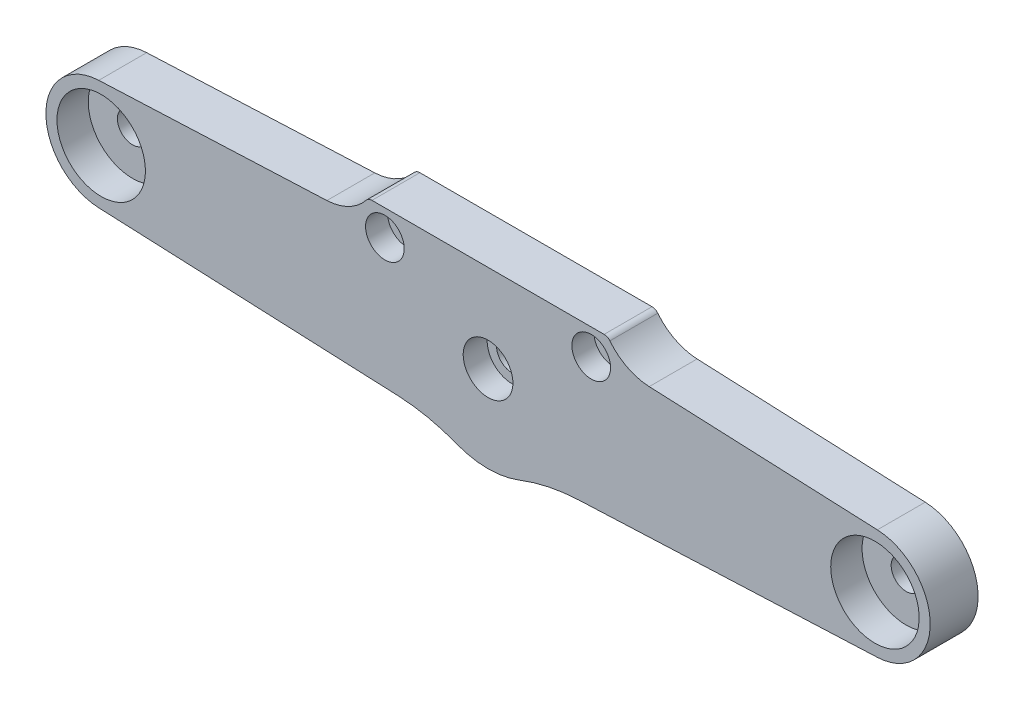
ISO-10303-21;
HEADER;
FILE_DESCRIPTION(('STEP AP214'),'2;1');
FILE_NAME('part.step','',(''),(''),'','','');
FILE_SCHEMA(('AUTOMOTIVE_DESIGN { 1 0 10303 214 1 1 1 1 }'));
ENDSEC;
DATA;
#1=APPLICATION_CONTEXT('core data for automotive mechanical design processes');
#2=APPLICATION_PROTOCOL_DEFINITION('international standard','automotive_design',2000,#1);
#3=PRODUCT_CONTEXT('',#1,'mechanical');
#4=PRODUCT('Part','Part','',(#3));
#5=PRODUCT_RELATED_PRODUCT_CATEGORY('part','',(#4));
#6=PRODUCT_DEFINITION_FORMATION('','',#4);
#7=PRODUCT_DEFINITION_CONTEXT('part definition',#1,'design');
#8=PRODUCT_DEFINITION('design','',#6,#7);
#9=PRODUCT_DEFINITION_SHAPE('','',#8);
#10=(LENGTH_UNIT() NAMED_UNIT(*) SI_UNIT(.MILLI.,.METRE.));
#11=(NAMED_UNIT(*) PLANE_ANGLE_UNIT() SI_UNIT($,.RADIAN.));
#12=(NAMED_UNIT(*) SI_UNIT($,.STERADIAN.) SOLID_ANGLE_UNIT());
#13=UNCERTAINTY_MEASURE_WITH_UNIT(LENGTH_MEASURE(1.E-05),#10,'distance_accuracy_value','');
#14=(GEOMETRIC_REPRESENTATION_CONTEXT(3) GLOBAL_UNCERTAINTY_ASSIGNED_CONTEXT((#13)) GLOBAL_UNIT_ASSIGNED_CONTEXT((#10,
#11,#12)) REPRESENTATION_CONTEXT('',''));
#15=CARTESIAN_POINT('',(0.,0.,0.));
#16=DIRECTION('',(0.,0.,1.));
#17=DIRECTION('',(1.,0.,0.));
#18=AXIS2_PLACEMENT_3D('',#15,#16,#17);
#19=CARTESIAN_POINT('',(0.,189.,75.25));
#20=DIRECTION('',(0.,0.,-1.));
#21=DIRECTION('',(-1.,0.,0.));
#22=AXIS2_PLACEMENT_3D('',#19,#20,#21);
#23=CYLINDRICAL_SURFACE('',#22,6.75);
#24=CARTESIAN_POINT('',(0.,189.,72.));
#25=DIRECTION('',(0.,0.,-1.));
#26=DIRECTION('',(-1.,0.,0.));
#27=AXIS2_PLACEMENT_3D('',#24,#25,#26);
#28=CIRCLE('',#27,6.75);
#29=CARTESIAN_POINT('',(-6.75,189.,72.));
#30=VERTEX_POINT('',#29);
#31=EDGE_CURVE('E179',#30,#30,#28,.T.);
#32=ORIENTED_EDGE('',*,*,#31,.T.);
#33=EDGE_LOOP('',(#32));
#34=FACE_BOUND('',#33,.T.);
#35=CARTESIAN_POINT('',(0.,189.,78.5));
#36=DIRECTION('',(0.,0.,-1.));
#37=DIRECTION('',(-1.,0.,0.));
#38=AXIS2_PLACEMENT_3D('',#35,#36,#37);
#39=CIRCLE('',#38,6.75);
#40=CARTESIAN_POINT('',(-6.75,189.,78.5));
#41=VERTEX_POINT('',#40);
#42=EDGE_CURVE('E19',#41,#41,#39,.T.);
#43=ORIENTED_EDGE('',*,*,#42,.F.);
#44=EDGE_LOOP('',(#43));
#45=FACE_BOUND('',#44,.T.);
#46=ADVANCED_FACE('F16',(#34,#45),#23,.F.);
#47=CARTESIAN_POINT('',(28.,205.85,75.5));
#48=DIRECTION('',(0.,0.,-1.));
#49=DIRECTION('',(-1.,0.,0.));
#50=AXIS2_PLACEMENT_3D('',#47,#48,#49);
#51=CYLINDRICAL_SURFACE('',#50,5.25);
#52=CARTESIAN_POINT('',(28.,205.85,72.5));
#53=DIRECTION('',(0.,0.,-1.));
#54=DIRECTION('',(-1.,0.,0.));
#55=AXIS2_PLACEMENT_3D('',#52,#53,#54);
#56=CIRCLE('',#55,5.25);
#57=CARTESIAN_POINT('',(22.75,205.85,72.5));
#58=VERTEX_POINT('',#57);
#59=EDGE_CURVE('E176',#58,#58,#56,.T.);
#60=ORIENTED_EDGE('',*,*,#59,.T.);
#61=EDGE_LOOP('',(#60));
#62=FACE_BOUND('',#61,.T.);
#63=CARTESIAN_POINT('',(28.,205.85,78.5));
#64=DIRECTION('',(0.,0.,-1.));
#65=DIRECTION('',(-1.,0.,0.));
#66=AXIS2_PLACEMENT_3D('',#63,#64,#65);
#67=CIRCLE('',#66,5.25);
#68=CARTESIAN_POINT('',(22.75,205.85,78.5));
#69=VERTEX_POINT('',#68);
#70=EDGE_CURVE('E190',#69,#69,#67,.T.);
#71=ORIENTED_EDGE('',*,*,#70,.F.);
#72=EDGE_LOOP('',(#71));
#73=FACE_BOUND('',#72,.T.);
#74=ADVANCED_FACE('F199',(#62,#73),#51,.F.);
#75=CARTESIAN_POINT('',(-28.,205.85,75.5));
#76=DIRECTION('',(0.,0.,-1.));
#77=DIRECTION('',(-1.,0.,0.));
#78=AXIS2_PLACEMENT_3D('',#75,#76,#77);
#79=CYLINDRICAL_SURFACE('',#78,5.25);
#80=CARTESIAN_POINT('',(-28.,205.85,72.5));
#81=DIRECTION('',(0.,0.,-1.));
#82=DIRECTION('',(-1.,0.,0.));
#83=AXIS2_PLACEMENT_3D('',#80,#81,#82);
#84=CIRCLE('',#83,5.25);
#85=CARTESIAN_POINT('',(-33.25,205.85,72.5));
#86=VERTEX_POINT('',#85);
#87=EDGE_CURVE('E173',#86,#86,#84,.T.);
#88=ORIENTED_EDGE('',*,*,#87,.T.);
#89=EDGE_LOOP('',(#88));
#90=FACE_BOUND('',#89,.T.);
#91=CARTESIAN_POINT('',(-28.,205.85,78.5));
#92=DIRECTION('',(0.,0.,-1.));
#93=DIRECTION('',(-1.,0.,0.));
#94=AXIS2_PLACEMENT_3D('',#91,#92,#93);
#95=CIRCLE('',#94,5.25);
#96=CARTESIAN_POINT('',(-33.25,205.85,78.5));
#97=VERTEX_POINT('',#96);
#98=EDGE_CURVE('E188',#97,#97,#95,.T.);
#99=ORIENTED_EDGE('',*,*,#98,.F.);
#100=EDGE_LOOP('',(#99));
#101=FACE_BOUND('',#100,.T.);
#102=ADVANCED_FACE('F205',(#90,#101),#79,.F.);
#103=CARTESIAN_POINT('',(105.,189.,78.5));
#104=DIRECTION('',(0.,0.,-1.));
#105=DIRECTION('',(-1.,0.,0.));
#106=AXIS2_PLACEMENT_3D('',#103,#104,#105);
#107=CYLINDRICAL_SURFACE('',#106,12.);
#108=CARTESIAN_POINT('',(105.,189.,70.));
#109=DIRECTION('',(0.,0.,-1.));
#110=DIRECTION('',(-1.,0.,0.));
#111=AXIS2_PLACEMENT_3D('',#108,#109,#110);
#112=CIRCLE('',#111,12.);
#113=CARTESIAN_POINT('',(93.,189.,70.));
#114=VERTEX_POINT('',#113);
#115=EDGE_CURVE('E170',#114,#114,#112,.F.);
#116=ORIENTED_EDGE('',*,*,#115,.F.);
#117=EDGE_LOOP('',(#116));
#118=FACE_BOUND('',#117,.T.);
#119=CARTESIAN_POINT('',(105.,189.,78.5));
#120=DIRECTION('',(0.,0.,-1.));
#121=DIRECTION('',(-1.,0.,0.));
#122=AXIS2_PLACEMENT_3D('',#119,#120,#121);
#123=CIRCLE('',#122,12.);
#124=CARTESIAN_POINT('',(93.,189.,78.5));
#125=VERTEX_POINT('',#124);
#126=EDGE_CURVE('E185',#125,#125,#123,.T.);
#127=ORIENTED_EDGE('',*,*,#126,.F.);
#128=EDGE_LOOP('',(#127));
#129=FACE_BOUND('',#128,.T.);
#130=ADVANCED_FACE('F314',(#118,#129),#107,.F.);
#131=CARTESIAN_POINT('',(-105.,189.,78.5));
#132=DIRECTION('',(0.,0.,-1.));
#133=DIRECTION('',(-1.,0.,0.));
#134=AXIS2_PLACEMENT_3D('',#131,#132,#133);
#135=CYLINDRICAL_SURFACE('',#134,12.);
#136=CARTESIAN_POINT('',(-105.,189.,70.));
#137=DIRECTION('',(0.,0.,-1.));
#138=DIRECTION('',(-1.,0.,0.));
#139=AXIS2_PLACEMENT_3D('',#136,#137,#138);
#140=CIRCLE('',#139,12.);
#141=CARTESIAN_POINT('',(-117.,189.,70.));
#142=VERTEX_POINT('',#141);
#143=EDGE_CURVE('E125',#142,#142,#140,.F.);
#144=ORIENTED_EDGE('',*,*,#143,.F.);
#145=EDGE_LOOP('',(#144));
#146=FACE_BOUND('',#145,.T.);
#147=CARTESIAN_POINT('',(-105.,189.,78.5));
#148=DIRECTION('',(0.,0.,-1.));
#149=DIRECTION('',(-1.,0.,0.));
#150=AXIS2_PLACEMENT_3D('',#147,#148,#149);
#151=CIRCLE('',#150,12.);
#152=CARTESIAN_POINT('',(-117.,189.,78.5));
#153=VERTEX_POINT('',#152);
#154=EDGE_CURVE('E182',#153,#153,#151,.T.);
#155=ORIENTED_EDGE('',*,*,#154,.F.);
#156=EDGE_LOOP('',(#155));
#157=FACE_BOUND('',#156,.T.);
#158=ADVANCED_FACE('F310',(#146,#157),#135,.F.);
#159=CARTESIAN_POINT('',(0.,189.175,78.5));
#160=DIRECTION('',(0.,0.,1.));
#161=DIRECTION('',(1.,0.,0.));
#162=AXIS2_PLACEMENT_3D('',#159,#160,#161);
#163=PLANE('',#162);
#164=ORIENTED_EDGE('',*,*,#154,.T.);
#165=EDGE_LOOP('',(#164));
#166=FACE_BOUND('',#165,.T.);
#167=ORIENTED_EDGE('',*,*,#126,.T.);
#168=EDGE_LOOP('',(#167));
#169=FACE_BOUND('',#168,.T.);
#170=ORIENTED_EDGE('',*,*,#98,.T.);
#171=EDGE_LOOP('',(#170));
#172=FACE_BOUND('',#171,.T.);
#173=ORIENTED_EDGE('',*,*,#70,.T.);
#174=EDGE_LOOP('',(#173));
#175=FACE_BOUND('',#174,.T.);
#176=ORIENTED_EDGE('',*,*,#42,.T.);
#177=EDGE_LOOP('',(#176));
#178=FACE_BOUND('',#177,.T.);
#179=CARTESIAN_POINT('',(31.5,210.85,78.5));
#180=DIRECTION('',(0.,0.,1.));
#181=DIRECTION('',(1.,0.,0.));
#182=AXIS2_PLACEMENT_3D('',#179,#180,#181);
#183=CIRCLE('',#182,2.00000000000001);
#184=CARTESIAN_POINT('',(31.5,212.85,78.5));
#185=VERTEX_POINT('',#184);
#186=CARTESIAN_POINT('',(33.0600095533375,212.101547119966,78.5));
#187=VERTEX_POINT('',#186);
#188=EDGE_CURVE('E142',#185,#187,#183,.F.);
#189=ORIENTED_EDGE('',*,*,#188,.F.);
#190=DIRECTION('',(-1.,0.,0.));
#191=VECTOR('',#190,1.);
#192=CARTESIAN_POINT('',(31.5,212.85,78.5));
#193=LINE('',#192,#191);
#194=CARTESIAN_POINT('',(-31.5,212.85,78.5));
#195=VERTEX_POINT('',#194);
#196=EDGE_CURVE('E135',#195,#185,#193,.F.);
#197=ORIENTED_EDGE('',*,*,#196,.F.);
#198=CARTESIAN_POINT('',(-31.5,210.85,78.5));
#199=DIRECTION('',(0.,0.,1.));
#200=DIRECTION('',(1.,0.,0.));
#201=AXIS2_PLACEMENT_3D('',#198,#199,#200);
#202=CIRCLE('',#201,2.);
#203=CARTESIAN_POINT('',(-33.0600095533376,212.101547119966,78.5));
#204=VERTEX_POINT('',#203);
#205=EDGE_CURVE('E128',#204,#195,#202,.F.);
#206=ORIENTED_EDGE('',*,*,#205,.F.);
#207=CARTESIAN_POINT('',(-44.370078815034,221.175263739722,78.5));
#208=DIRECTION('',(0.,0.,1.));
#209=DIRECTION('',(1.,0.,0.));
#210=AXIS2_PLACEMENT_3D('',#207,#208,#209);
#211=CIRCLE('',#210,14.5);
#212=CARTESIAN_POINT('',(-43.7375976982367,206.689064526785,78.5));
#213=VERTEX_POINT('',#212);
#214=EDGE_CURVE('E115',#204,#213,#211,.F.);
#215=ORIENTED_EDGE('',*,*,#214,.T.);
#216=DIRECTION('',(-0.999048221581858,-0.0436193873653279,0.));
#217=VECTOR('',#216,1.);
#218=CARTESIAN_POINT('',(-43.7375976982367,206.689064526785,78.5));
#219=LINE('',#218,#217);
#220=CARTESIAN_POINT('',(-105.65429081048,203.985723323728,78.5));
#221=VERTEX_POINT('',#220);
#222=EDGE_CURVE('E124',#221,#213,#219,.F.);
#223=ORIENTED_EDGE('',*,*,#222,.F.);
#224=CARTESIAN_POINT('',(-105.,189.,78.5));
#225=DIRECTION('',(0.,0.,1.));
#226=DIRECTION('',(1.,0.,0.));
#227=AXIS2_PLACEMENT_3D('',#224,#225,#226);
#228=CIRCLE('',#227,15.);
#229=CARTESIAN_POINT('',(-105.65429081048,174.014276676272,78.5));
#230=VERTEX_POINT('',#229);
#231=EDGE_CURVE('E165',#230,#221,#228,.F.);
#232=ORIENTED_EDGE('',*,*,#231,.F.);
#233=DIRECTION('',(0.999048221581858,-0.0436193873653357,0.));
#234=VECTOR('',#233,1.);
#235=CARTESIAN_POINT('',(-105.65429081048,174.014276676272,78.5));
#236=LINE('',#235,#234);
#237=CARTESIAN_POINT('',(-24.5141938105685,170.471623533568,78.5));
#238=VERTEX_POINT('',#237);
#239=EDGE_CURVE('E584',#238,#230,#236,.F.);
#240=ORIENTED_EDGE('',*,*,#239,.F.);
#241=CARTESIAN_POINT('',(-26.6951631788352,120.519212454475,78.5));
#242=DIRECTION('',(0.,0.,1.));
#243=DIRECTION('',(1.,0.,0.));
#244=AXIS2_PLACEMENT_3D('',#241,#242,#243);
#245=CIRCLE('',#244,50.);
#246=CARTESIAN_POINT('',(-8.53518822724664,167.104782213336,78.5));
#247=VERTEX_POINT('',#246);
#248=EDGE_CURVE('E161',#238,#247,#245,.F.);
#249=ORIENTED_EDGE('',*,*,#248,.T.);
#250=CARTESIAN_POINT('',(0.,189.,78.5));
#251=DIRECTION('',(0.,0.,1.));
#252=DIRECTION('',(1.,0.,0.));
#253=AXIS2_PLACEMENT_3D('',#250,#251,#252);
#254=CIRCLE('',#253,23.4999999999998);
#255=CARTESIAN_POINT('',(8.53518822724665,167.104782213336,78.5));
#256=VERTEX_POINT('',#255);
#257=EDGE_CURVE('E158',#256,#247,#254,.F.);
#258=ORIENTED_EDGE('',*,*,#257,.F.);
#259=CARTESIAN_POINT('',(26.6951631788352,120.519212454475,78.5));
#260=DIRECTION('',(0.,0.,1.));
#261=DIRECTION('',(1.,0.,0.));
#262=AXIS2_PLACEMENT_3D('',#259,#260,#261);
#263=CIRCLE('',#262,50.);
#264=CARTESIAN_POINT('',(24.5141938105685,170.471623533568,78.5));
#265=VERTEX_POINT('',#264);
#266=EDGE_CURVE('E153',#256,#265,#263,.F.);
#267=ORIENTED_EDGE('',*,*,#266,.T.);
#268=DIRECTION('',(0.999048221581858,0.0436193873653353,0.));
#269=VECTOR('',#268,1.);
#270=CARTESIAN_POINT('',(24.5141938105685,170.471623533568,78.5));
#271=LINE('',#270,#269);
#272=CARTESIAN_POINT('',(105.65429081048,174.014276676272,78.5));
#273=VERTEX_POINT('',#272);
#274=EDGE_CURVE('E156',#273,#265,#271,.F.);
#275=ORIENTED_EDGE('',*,*,#274,.F.);
#276=CARTESIAN_POINT('',(105.,189.,78.5));
#277=DIRECTION('',(0.,0.,1.));
#278=DIRECTION('',(1.,0.,0.));
#279=AXIS2_PLACEMENT_3D('',#276,#277,#278);
#280=CIRCLE('',#279,15.);
#281=CARTESIAN_POINT('',(105.65429081048,203.985723323728,78.5));
#282=VERTEX_POINT('',#281);
#283=EDGE_CURVE('E149',#282,#273,#280,.F.);
#284=ORIENTED_EDGE('',*,*,#283,.F.);
#285=DIRECTION('',(-0.999048221581858,0.0436193873653286,0.));
#286=VECTOR('',#285,1.);
#287=CARTESIAN_POINT('',(105.65429081048,203.985723323728,78.5));
#288=LINE('',#287,#286);
#289=CARTESIAN_POINT('',(43.7375976982367,206.689064526785,78.5));
#290=VERTEX_POINT('',#289);
#291=EDGE_CURVE('E588',#290,#282,#288,.F.);
#292=ORIENTED_EDGE('',*,*,#291,.F.);
#293=CARTESIAN_POINT('',(44.370078815034,221.175263739722,78.5));
#294=DIRECTION('',(0.,0.,1.));
#295=DIRECTION('',(1.,0.,0.));
#296=AXIS2_PLACEMENT_3D('',#293,#294,#295);
#297=CIRCLE('',#296,14.5);
#298=EDGE_CURVE('E145',#290,#187,#297,.F.);
#299=ORIENTED_EDGE('',*,*,#298,.T.);
#300=EDGE_LOOP('',(#189,#197,#206,#215,#223,#232,#240,#249,#258,#267,#275,#284,#292,#299));
#301=FACE_BOUND('',#300,.T.);
#302=ADVANCED_FACE('F134',(#166,#169,#172,#175,#178,#301),#163,.T.);
#303=CARTESIAN_POINT('',(0.,189.,72.));
#304=DIRECTION('',(0.,0.,-1.));
#305=DIRECTION('',(-1.,0.,0.));
#306=AXIS2_PLACEMENT_3D('',#303,#304,#305);
#307=PLANE('',#306);
#308=CARTESIAN_POINT('',(0.,189.,72.));
#309=DIRECTION('',(0.,0.,-1.));
#310=DIRECTION('',(-1.,0.,0.));
#311=AXIS2_PLACEMENT_3D('',#308,#309,#310);
#312=CIRCLE('',#311,4.2);
#313=CARTESIAN_POINT('',(-4.2,189.,72.));
#314=VERTEX_POINT('',#313);
#315=EDGE_CURVE('E137',#314,#314,#312,.T.);
#316=ORIENTED_EDGE('',*,*,#315,.T.);
#317=EDGE_LOOP('',(#316));
#318=FACE_BOUND('',#317,.T.);
#319=ORIENTED_EDGE('',*,*,#31,.F.);
#320=EDGE_LOOP('',(#319));
#321=FACE_BOUND('',#320,.T.);
#322=ADVANCED_FACE('F303',(#318,#321),#307,.F.);
#323=CARTESIAN_POINT('',(28.,205.85,72.5));
#324=DIRECTION('',(0.,0.,-1.));
#325=DIRECTION('',(-1.,0.,0.));
#326=AXIS2_PLACEMENT_3D('',#323,#324,#325);
#327=PLANE('',#326);
#328=CARTESIAN_POINT('',(28.,205.85,72.5));
#329=DIRECTION('',(0.,0.,-1.));
#330=DIRECTION('',(-1.,0.,0.));
#331=AXIS2_PLACEMENT_3D('',#328,#329,#330);
#332=CIRCLE('',#331,3.2);
#333=CARTESIAN_POINT('',(24.8,205.85,72.5));
#334=VERTEX_POINT('',#333);
#335=EDGE_CURVE('E529',#334,#334,#332,.T.);
#336=ORIENTED_EDGE('',*,*,#335,.T.);
#337=EDGE_LOOP('',(#336));
#338=FACE_BOUND('',#337,.T.);
#339=ORIENTED_EDGE('',*,*,#59,.F.);
#340=EDGE_LOOP('',(#339));
#341=FACE_BOUND('',#340,.T.);
#342=ADVANCED_FACE('F299',(#338,#341),#327,.F.);
#343=CARTESIAN_POINT('',(-28.,205.85,72.5));
#344=DIRECTION('',(0.,0.,-1.));
#345=DIRECTION('',(-1.,0.,0.));
#346=AXIS2_PLACEMENT_3D('',#343,#344,#345);
#347=PLANE('',#346);
#348=CARTESIAN_POINT('',(-28.,205.85,72.5));
#349=DIRECTION('',(0.,0.,-1.));
#350=DIRECTION('',(-1.,0.,0.));
#351=AXIS2_PLACEMENT_3D('',#348,#349,#350);
#352=CIRCLE('',#351,3.2);
#353=CARTESIAN_POINT('',(-31.2,205.85,72.5));
#354=VERTEX_POINT('',#353);
#355=EDGE_CURVE('E531',#354,#354,#352,.T.);
#356=ORIENTED_EDGE('',*,*,#355,.T.);
#357=EDGE_LOOP('',(#356));
#358=FACE_BOUND('',#357,.T.);
#359=ORIENTED_EDGE('',*,*,#87,.F.);
#360=EDGE_LOOP('',(#359));
#361=FACE_BOUND('',#360,.T.);
#362=ADVANCED_FACE('F295',(#358,#361),#347,.F.);
#363=CARTESIAN_POINT('',(105.,189.,70.));
#364=DIRECTION('',(0.,0.,1.));
#365=DIRECTION('',(1.,0.,0.));
#366=AXIS2_PLACEMENT_3D('',#363,#364,#365);
#367=PLANE('',#366);
#368=CARTESIAN_POINT('',(105.,189.,70.));
#369=DIRECTION('',(0.,0.,-1.));
#370=DIRECTION('',(0.,1.,0.));
#371=AXIS2_PLACEMENT_3D('',#368,#369,#370);
#372=CIRCLE('',#371,4.1);
#373=CARTESIAN_POINT('',(105.,193.1,70.));
#374=VERTEX_POINT('',#373);
#375=EDGE_CURVE('E534',#374,#374,#372,.T.);
#376=ORIENTED_EDGE('',*,*,#375,.T.);
#377=EDGE_LOOP('',(#376));
#378=FACE_BOUND('',#377,.T.);
#379=ORIENTED_EDGE('',*,*,#115,.T.);
#380=EDGE_LOOP('',(#379));
#381=FACE_BOUND('',#380,.T.);
#382=ADVANCED_FACE('F291',(#378,#381),#367,.T.);
#383=CARTESIAN_POINT('',(-105.,189.,70.));
#384=DIRECTION('',(0.,0.,1.));
#385=DIRECTION('',(1.,0.,0.));
#386=AXIS2_PLACEMENT_3D('',#383,#384,#385);
#387=PLANE('',#386);
#388=CARTESIAN_POINT('',(-105.,189.,70.));
#389=DIRECTION('',(0.,0.,-1.));
#390=DIRECTION('',(0.,1.,0.));
#391=AXIS2_PLACEMENT_3D('',#388,#389,#390);
#392=CIRCLE('',#391,4.1);
#393=CARTESIAN_POINT('',(-105.,193.1,70.));
#394=VERTEX_POINT('',#393);
#395=EDGE_CURVE('E539',#394,#394,#392,.T.);
#396=ORIENTED_EDGE('',*,*,#395,.T.);
#397=EDGE_LOOP('',(#396));
#398=FACE_BOUND('',#397,.T.);
#399=ORIENTED_EDGE('',*,*,#143,.T.);
#400=EDGE_LOOP('',(#399));
#401=FACE_BOUND('',#400,.T.);
#402=ADVANCED_FACE('F288',(#398,#401),#387,.T.);
#403=CARTESIAN_POINT('',(-44.370078815034,221.175263739722,65.5));
#404=DIRECTION('',(0.,0.,1.));
#405=DIRECTION('',(1.,0.,0.));
#406=AXIS2_PLACEMENT_3D('',#403,#404,#405);
#407=CYLINDRICAL_SURFACE('',#406,14.5);
#408=DIRECTION('',(0.,0.,1.));
#409=VECTOR('',#408,1.);
#410=CARTESIAN_POINT('',(-43.7375976982367,206.689064526785,65.5));
#411=LINE('',#410,#409);
#412=CARTESIAN_POINT('',(-43.7375976982367,206.689064526785,65.5));
#413=VERTEX_POINT('',#412);
#414=EDGE_CURVE('E120',#213,#413,#411,.F.);
#415=ORIENTED_EDGE('',*,*,#414,.F.);
#416=ORIENTED_EDGE('',*,*,#214,.F.);
#417=DIRECTION('',(0.,0.,1.));
#418=VECTOR('',#417,1.);
#419=CARTESIAN_POINT('',(-33.0600095533376,212.101547119966,65.5));
#420=LINE('',#419,#418);
#421=CARTESIAN_POINT('',(-33.0600095533376,212.101547119966,65.5));
#422=VERTEX_POINT('',#421);
#423=EDGE_CURVE('E119',#422,#204,#420,.T.);
#424=ORIENTED_EDGE('',*,*,#423,.F.);
#425=CARTESIAN_POINT('',(-44.370078815034,221.175263739722,65.5));
#426=DIRECTION('',(0.,0.,1.));
#427=DIRECTION('',(1.,0.,0.));
#428=AXIS2_PLACEMENT_3D('',#425,#426,#427);
#429=CIRCLE('',#428,14.5);
#430=EDGE_CURVE('E542',#422,#413,#429,.F.);
#431=ORIENTED_EDGE('',*,*,#430,.T.);
#432=EDGE_LOOP('',(#415,#416,#424,#431));
#433=FACE_BOUND('',#432,.T.);
#434=ADVANCED_FACE('F117',(#433),#407,.F.);
#435=CARTESIAN_POINT('',(-43.7375976982367,206.689064526785,65.5));
#436=DIRECTION('',(-0.0436193873653279,0.999048221581858,0.));
#437=DIRECTION('',(-0.999048221581858,-0.0436193873653279,0.));
#438=AXIS2_PLACEMENT_3D('',#435,#436,#437);
#439=PLANE('',#438);
#440=ORIENTED_EDGE('',*,*,#222,.T.);
#441=ORIENTED_EDGE('',*,*,#414,.T.);
#442=DIRECTION('',(-0.999048221581858,-0.0436193873653274,0.));
#443=VECTOR('',#442,1.);
#444=CARTESIAN_POINT('',(-43.7375976982367,206.689064526785,65.5));
#445=LINE('',#444,#443);
#446=CARTESIAN_POINT('',(-105.65429081048,203.985723323728,65.5));
#447=VERTEX_POINT('',#446);
#448=EDGE_CURVE('E544',#413,#447,#445,.T.);
#449=ORIENTED_EDGE('',*,*,#448,.T.);
#450=DIRECTION('',(0.,0.,1.));
#451=VECTOR('',#450,1.);
#452=CARTESIAN_POINT('',(-105.65429081048,203.985723323728,65.5));
#453=LINE('',#452,#451);
#454=EDGE_CURVE('E166',#221,#447,#453,.F.);
#455=ORIENTED_EDGE('',*,*,#454,.F.);
#456=EDGE_LOOP('',(#440,#441,#449,#455));
#457=FACE_BOUND('',#456,.T.);
#458=ADVANCED_FACE('F281',(#457),#439,.T.);
#459=CARTESIAN_POINT('',(-105.,189.,65.5));
#460=DIRECTION('',(0.,0.,1.));
#461=DIRECTION('',(1.,0.,0.));
#462=AXIS2_PLACEMENT_3D('',#459,#460,#461);
#463=CYLINDRICAL_SURFACE('',#462,15.);
#464=ORIENTED_EDGE('',*,*,#231,.T.);
#465=ORIENTED_EDGE('',*,*,#454,.T.);
#466=CARTESIAN_POINT('',(-105.,189.,65.5));
#467=DIRECTION('',(0.,0.,1.));
#468=DIRECTION('',(1.,0.,0.));
#469=AXIS2_PLACEMENT_3D('',#466,#467,#468);
#470=CIRCLE('',#469,15.);
#471=CARTESIAN_POINT('',(-105.65429081048,174.014276676272,65.5));
#472=VERTEX_POINT('',#471);
#473=EDGE_CURVE('E545',#447,#472,#470,.T.);
#474=ORIENTED_EDGE('',*,*,#473,.T.);
#475=DIRECTION('',(0.,0.,1.));
#476=VECTOR('',#475,1.);
#477=CARTESIAN_POINT('',(-105.65429081048,174.014276676272,65.5));
#478=LINE('',#477,#476);
#479=EDGE_CURVE('E586',#230,#472,#478,.F.);
#480=ORIENTED_EDGE('',*,*,#479,.F.);
#481=EDGE_LOOP('',(#464,#465,#474,#480));
#482=FACE_BOUND('',#481,.T.);
#483=ADVANCED_FACE('F277',(#482),#463,.T.);
#484=CARTESIAN_POINT('',(-105.65429081048,174.014276676272,65.5));
#485=DIRECTION('',(-0.0436193873653357,-0.999048221581858,0.));
#486=DIRECTION('',(0.999048221581858,-0.0436193873653357,0.));
#487=AXIS2_PLACEMENT_3D('',#484,#485,#486);
#488=PLANE('',#487);
#489=ORIENTED_EDGE('',*,*,#239,.T.);
#490=ORIENTED_EDGE('',*,*,#479,.T.);
#491=DIRECTION('',(0.999048221581858,-0.043619387365333,0.));
#492=VECTOR('',#491,1.);
#493=CARTESIAN_POINT('',(-105.65429081048,174.014276676272,65.5));
#494=LINE('',#493,#492);
#495=CARTESIAN_POINT('',(-24.5141938105685,170.471623533568,65.5));
#496=VERTEX_POINT('',#495);
#497=EDGE_CURVE('E548',#472,#496,#494,.T.);
#498=ORIENTED_EDGE('',*,*,#497,.T.);
#499=DIRECTION('',(0.,0.,1.));
#500=VECTOR('',#499,1.);
#501=CARTESIAN_POINT('',(-24.5141938105685,170.471623533568,65.5));
#502=LINE('',#501,#500);
#503=EDGE_CURVE('E164',#496,#238,#502,.T.);
#504=ORIENTED_EDGE('',*,*,#503,.T.);
#505=EDGE_LOOP('',(#489,#490,#498,#504));
#506=FACE_BOUND('',#505,.T.);
#507=ADVANCED_FACE('F273',(#506),#488,.T.);
#508=CARTESIAN_POINT('',(-26.6951631788352,120.519212454475,65.5));
#509=DIRECTION('',(0.,0.,1.));
#510=DIRECTION('',(1.,0.,0.));
#511=AXIS2_PLACEMENT_3D('',#508,#509,#510);
#512=CYLINDRICAL_SURFACE('',#511,50.);
#513=DIRECTION('',(0.,0.,1.));
#514=VECTOR('',#513,1.);
#515=CARTESIAN_POINT('',(-8.53518822724671,167.104782213336,65.5));
#516=LINE('',#515,#514);
#517=CARTESIAN_POINT('',(-8.53518822724664,167.104782213336,65.5));
#518=VERTEX_POINT('',#517);
#519=EDGE_CURVE('E160',#247,#518,#516,.F.);
#520=ORIENTED_EDGE('',*,*,#519,.F.);
#521=ORIENTED_EDGE('',*,*,#248,.F.);
#522=ORIENTED_EDGE('',*,*,#503,.F.);
#523=CARTESIAN_POINT('',(-26.6951631788352,120.519212454475,65.5));
#524=DIRECTION('',(0.,0.,1.));
#525=DIRECTION('',(1.,0.,0.));
#526=AXIS2_PLACEMENT_3D('',#523,#524,#525);
#527=CIRCLE('',#526,50.);
#528=EDGE_CURVE('E549',#496,#518,#527,.F.);
#529=ORIENTED_EDGE('',*,*,#528,.T.);
#530=EDGE_LOOP('',(#520,#521,#522,#529));
#531=FACE_BOUND('',#530,.T.);
#532=ADVANCED_FACE('F269',(#531),#512,.F.);
#533=CARTESIAN_POINT('',(0.,189.,65.5));
#534=DIRECTION('',(0.,0.,1.));
#535=DIRECTION('',(1.,0.,0.));
#536=AXIS2_PLACEMENT_3D('',#533,#534,#535);
#537=CYLINDRICAL_SURFACE('',#536,23.4999999999998);
#538=ORIENTED_EDGE('',*,*,#257,.T.);
#539=ORIENTED_EDGE('',*,*,#519,.T.);
#540=CARTESIAN_POINT('',(0.,189.,65.5));
#541=DIRECTION('',(0.,0.,1.));
#542=DIRECTION('',(1.,0.,0.));
#543=AXIS2_PLACEMENT_3D('',#540,#541,#542);
#544=CIRCLE('',#543,23.4999999999998);
#545=CARTESIAN_POINT('',(8.53518822724665,167.104782213336,65.5));
#546=VERTEX_POINT('',#545);
#547=EDGE_CURVE('E552',#518,#546,#544,.T.);
#548=ORIENTED_EDGE('',*,*,#547,.T.);
#549=DIRECTION('',(0.,0.,1.));
#550=VECTOR('',#549,1.);
#551=CARTESIAN_POINT('',(8.53518822724672,167.104782213336,65.5));
#552=LINE('',#551,#550);
#553=EDGE_CURVE('E157',#546,#256,#552,.T.);
#554=ORIENTED_EDGE('',*,*,#553,.T.);
#555=EDGE_LOOP('',(#538,#539,#548,#554));
#556=FACE_BOUND('',#555,.T.);
#557=ADVANCED_FACE('F265',(#556),#537,.T.);
#558=CARTESIAN_POINT('',(26.6951631788352,120.519212454475,65.5));
#559=DIRECTION('',(0.,0.,1.));
#560=DIRECTION('',(1.,0.,0.));
#561=AXIS2_PLACEMENT_3D('',#558,#559,#560);
#562=CYLINDRICAL_SURFACE('',#561,50.);
#563=DIRECTION('',(0.,0.,1.));
#564=VECTOR('',#563,1.);
#565=CARTESIAN_POINT('',(24.5141938105685,170.471623533568,65.5));
#566=LINE('',#565,#564);
#567=CARTESIAN_POINT('',(24.5141938105685,170.471623533568,65.5));
#568=VERTEX_POINT('',#567);
#569=EDGE_CURVE('E152',#265,#568,#566,.F.);
#570=ORIENTED_EDGE('',*,*,#569,.F.);
#571=ORIENTED_EDGE('',*,*,#266,.F.);
#572=ORIENTED_EDGE('',*,*,#553,.F.);
#573=CARTESIAN_POINT('',(26.6951631788352,120.519212454475,65.5));
#574=DIRECTION('',(0.,0.,1.));
#575=DIRECTION('',(1.,0.,0.));
#576=AXIS2_PLACEMENT_3D('',#573,#574,#575);
#577=CIRCLE('',#576,50.);
#578=EDGE_CURVE('E555',#546,#568,#577,.F.);
#579=ORIENTED_EDGE('',*,*,#578,.T.);
#580=EDGE_LOOP('',(#570,#571,#572,#579));
#581=FACE_BOUND('',#580,.T.);
#582=ADVANCED_FACE('F261',(#581),#562,.F.);
#583=CARTESIAN_POINT('',(24.5141938105685,170.471623533568,65.5));
#584=DIRECTION('',(0.0436193873653353,-0.999048221581858,0.));
#585=DIRECTION('',(0.999048221581858,0.0436193873653353,0.));
#586=AXIS2_PLACEMENT_3D('',#583,#584,#585);
#587=PLANE('',#586);
#588=ORIENTED_EDGE('',*,*,#274,.T.);
#589=ORIENTED_EDGE('',*,*,#569,.T.);
#590=DIRECTION('',(0.999048221581858,0.043619387365333,0.));
#591=VECTOR('',#590,1.);
#592=CARTESIAN_POINT('',(24.5141938105685,170.471623533568,65.5));
#593=LINE('',#592,#591);
#594=CARTESIAN_POINT('',(105.65429081048,174.014276676272,65.5));
#595=VERTEX_POINT('',#594);
#596=EDGE_CURVE('E558',#568,#595,#593,.T.);
#597=ORIENTED_EDGE('',*,*,#596,.T.);
#598=DIRECTION('',(0.,0.,1.));
#599=VECTOR('',#598,1.);
#600=CARTESIAN_POINT('',(105.65429081048,174.014276676272,65.5));
#601=LINE('',#600,#599);
#602=EDGE_CURVE('E151',#273,#595,#601,.F.);
#603=ORIENTED_EDGE('',*,*,#602,.F.);
#604=EDGE_LOOP('',(#588,#589,#597,#603));
#605=FACE_BOUND('',#604,.T.);
#606=ADVANCED_FACE('F257',(#605),#587,.T.);
#607=CARTESIAN_POINT('',(105.,189.,65.5));
#608=DIRECTION('',(0.,0.,1.));
#609=DIRECTION('',(1.,0.,0.));
#610=AXIS2_PLACEMENT_3D('',#607,#608,#609);
#611=CYLINDRICAL_SURFACE('',#610,15.);
#612=ORIENTED_EDGE('',*,*,#283,.T.);
#613=ORIENTED_EDGE('',*,*,#602,.T.);
#614=CARTESIAN_POINT('',(105.,189.,65.5));
#615=DIRECTION('',(0.,0.,1.));
#616=DIRECTION('',(1.,0.,0.));
#617=AXIS2_PLACEMENT_3D('',#614,#615,#616);
#618=CIRCLE('',#617,15.);
#619=CARTESIAN_POINT('',(105.65429081048,203.985723323728,65.5));
#620=VERTEX_POINT('',#619);
#621=EDGE_CURVE('E559',#595,#620,#618,.T.);
#622=ORIENTED_EDGE('',*,*,#621,.T.);
#623=DIRECTION('',(0.,0.,1.));
#624=VECTOR('',#623,1.);
#625=CARTESIAN_POINT('',(105.65429081048,203.985723323728,65.5));
#626=LINE('',#625,#624);
#627=EDGE_CURVE('E590',#282,#620,#626,.F.);
#628=ORIENTED_EDGE('',*,*,#627,.F.);
#629=EDGE_LOOP('',(#612,#613,#622,#628));
#630=FACE_BOUND('',#629,.T.);
#631=ADVANCED_FACE('F253',(#630),#611,.T.);
#632=CARTESIAN_POINT('',(105.65429081048,203.985723323728,65.5));
#633=DIRECTION('',(0.0436193873653286,0.999048221581858,0.));
#634=DIRECTION('',(-0.999048221581858,0.0436193873653286,0.));
#635=AXIS2_PLACEMENT_3D('',#632,#633,#634);
#636=PLANE('',#635);
#637=ORIENTED_EDGE('',*,*,#291,.T.);
#638=ORIENTED_EDGE('',*,*,#627,.T.);
#639=DIRECTION('',(-0.999048221581858,0.0436193873653274,0.));
#640=VECTOR('',#639,1.);
#641=CARTESIAN_POINT('',(105.65429081048,203.985723323728,65.5));
#642=LINE('',#641,#640);
#643=CARTESIAN_POINT('',(43.7375976982367,206.689064526785,65.5));
#644=VERTEX_POINT('',#643);
#645=EDGE_CURVE('E562',#620,#644,#642,.T.);
#646=ORIENTED_EDGE('',*,*,#645,.T.);
#647=DIRECTION('',(0.,0.,1.));
#648=VECTOR('',#647,1.);
#649=CARTESIAN_POINT('',(43.7375976982367,206.689064526785,65.5));
#650=LINE('',#649,#648);
#651=EDGE_CURVE('E148',#644,#290,#650,.T.);
#652=ORIENTED_EDGE('',*,*,#651,.T.);
#653=EDGE_LOOP('',(#637,#638,#646,#652));
#654=FACE_BOUND('',#653,.T.);
#655=ADVANCED_FACE('F249',(#654),#636,.T.);
#656=CARTESIAN_POINT('',(44.370078815034,221.175263739722,65.5));
#657=DIRECTION('',(0.,0.,1.));
#658=DIRECTION('',(1.,0.,0.));
#659=AXIS2_PLACEMENT_3D('',#656,#657,#658);
#660=CYLINDRICAL_SURFACE('',#659,14.5);
#661=DIRECTION('',(0.,0.,1.));
#662=VECTOR('',#661,1.);
#663=CARTESIAN_POINT('',(33.0600095533376,212.101547119966,65.5));
#664=LINE('',#663,#662);
#665=CARTESIAN_POINT('',(33.0600095533375,212.101547119966,65.5));
#666=VERTEX_POINT('',#665);
#667=EDGE_CURVE('E144',#187,#666,#664,.F.);
#668=ORIENTED_EDGE('',*,*,#667,.F.);
#669=ORIENTED_EDGE('',*,*,#298,.F.);
#670=ORIENTED_EDGE('',*,*,#651,.F.);
#671=CARTESIAN_POINT('',(44.370078815034,221.175263739722,65.5));
#672=DIRECTION('',(0.,0.,1.));
#673=DIRECTION('',(1.,0.,0.));
#674=AXIS2_PLACEMENT_3D('',#671,#672,#673);
#675=CIRCLE('',#674,14.5);
#676=EDGE_CURVE('E563',#644,#666,#675,.F.);
#677=ORIENTED_EDGE('',*,*,#676,.T.);
#678=EDGE_LOOP('',(#668,#669,#670,#677));
#679=FACE_BOUND('',#678,.T.);
#680=ADVANCED_FACE('F245',(#679),#660,.F.);
#681=CARTESIAN_POINT('',(31.5,210.85,65.5));
#682=DIRECTION('',(0.,0.,1.));
#683=DIRECTION('',(1.,0.,0.));
#684=AXIS2_PLACEMENT_3D('',#681,#682,#683);
#685=CYLINDRICAL_SURFACE('',#684,2.00000000000001);
#686=ORIENTED_EDGE('',*,*,#188,.T.);
#687=ORIENTED_EDGE('',*,*,#667,.T.);
#688=CARTESIAN_POINT('',(31.5,210.85,65.5));
#689=DIRECTION('',(0.,0.,1.));
#690=DIRECTION('',(1.,0.,0.));
#691=AXIS2_PLACEMENT_3D('',#688,#689,#690);
#692=CIRCLE('',#691,2.00000000000001);
#693=CARTESIAN_POINT('',(31.5,212.85,65.5));
#694=VERTEX_POINT('',#693);
#695=EDGE_CURVE('E566',#666,#694,#692,.T.);
#696=ORIENTED_EDGE('',*,*,#695,.T.);
#697=DIRECTION('',(0.,0.,1.));
#698=VECTOR('',#697,1.);
#699=CARTESIAN_POINT('',(31.5,212.85,65.5));
#700=LINE('',#699,#698);
#701=EDGE_CURVE('E131',#185,#694,#700,.F.);
#702=ORIENTED_EDGE('',*,*,#701,.F.);
#703=EDGE_LOOP('',(#686,#687,#696,#702));
#704=FACE_BOUND('',#703,.T.);
#705=ADVANCED_FACE('F241',(#704),#685,.T.);
#706=CARTESIAN_POINT('',(31.5,212.85,65.5));
#707=DIRECTION('',(0.,1.,0.));
#708=DIRECTION('',(-1.,0.,0.));
#709=AXIS2_PLACEMENT_3D('',#706,#707,#708);
#710=PLANE('',#709);
#711=ORIENTED_EDGE('',*,*,#196,.T.);
#712=ORIENTED_EDGE('',*,*,#701,.T.);
#713=DIRECTION('',(1.,0.,0.));
#714=VECTOR('',#713,1.);
#715=CARTESIAN_POINT('',(0.,212.85,65.5));
#716=LINE('',#715,#714);
#717=CARTESIAN_POINT('',(-31.5,212.85,65.5));
#718=VERTEX_POINT('',#717);
#719=EDGE_CURVE('E569',#694,#718,#716,.F.);
#720=ORIENTED_EDGE('',*,*,#719,.T.);
#721=DIRECTION('',(0.,0.,1.));
#722=VECTOR('',#721,1.);
#723=CARTESIAN_POINT('',(-31.5,212.85,65.5));
#724=LINE('',#723,#722);
#725=EDGE_CURVE('E34',#195,#718,#724,.F.);
#726=ORIENTED_EDGE('',*,*,#725,.F.);
#727=EDGE_LOOP('',(#711,#712,#720,#726));
#728=FACE_BOUND('',#727,.T.);
#729=ADVANCED_FACE('F238',(#728),#710,.T.);
#730=CARTESIAN_POINT('',(-31.5,210.85,65.5));
#731=DIRECTION('',(0.,0.,1.));
#732=DIRECTION('',(1.,0.,0.));
#733=AXIS2_PLACEMENT_3D('',#730,#731,#732);
#734=CYLINDRICAL_SURFACE('',#733,2.);
#735=ORIENTED_EDGE('',*,*,#205,.T.);
#736=ORIENTED_EDGE('',*,*,#725,.T.);
#737=CARTESIAN_POINT('',(-31.5,210.85,65.5));
#738=DIRECTION('',(0.,0.,1.));
#739=DIRECTION('',(1.,0.,0.));
#740=AXIS2_PLACEMENT_3D('',#737,#738,#739);
#741=CIRCLE('',#740,2.);
#742=EDGE_CURVE('E130',#718,#422,#741,.T.);
#743=ORIENTED_EDGE('',*,*,#742,.T.);
#744=ORIENTED_EDGE('',*,*,#423,.T.);
#745=EDGE_LOOP('',(#735,#736,#743,#744));
#746=FACE_BOUND('',#745,.T.);
#747=ADVANCED_FACE('F127',(#746),#734,.T.);
#748=CARTESIAN_POINT('',(0.,189.,63.287));
#749=DIRECTION('',(0.,0.,-1.));
#750=DIRECTION('',(-1.,0.,0.));
#751=AXIS2_PLACEMENT_3D('',#748,#749,#750);
#752=CYLINDRICAL_SURFACE('',#751,4.2);
#753=CARTESIAN_POINT('',(0.,189.,65.5));
#754=DIRECTION('',(0.,0.,-1.));
#755=DIRECTION('',(-1.,0.,0.));
#756=AXIS2_PLACEMENT_3D('',#753,#754,#755);
#757=CIRCLE('',#756,4.2);
#758=CARTESIAN_POINT('',(-4.2,189.,65.5));
#759=VERTEX_POINT('',#758);
#760=EDGE_CURVE('E571',#759,#759,#757,.T.);
#761=ORIENTED_EDGE('',*,*,#760,.T.);
#762=EDGE_LOOP('',(#761));
#763=FACE_BOUND('',#762,.T.);
#764=ORIENTED_EDGE('',*,*,#315,.F.);
#765=EDGE_LOOP('',(#764));
#766=FACE_BOUND('',#765,.T.);
#767=ADVANCED_FACE('F231',(#763,#766),#752,.F.);
#768=CARTESIAN_POINT('',(28.,205.85,62.11));
#769=DIRECTION('',(0.,0.,-1.));
#770=DIRECTION('',(-1.,0.,0.));
#771=AXIS2_PLACEMENT_3D('',#768,#769,#770);
#772=CYLINDRICAL_SURFACE('',#771,3.2);
#773=CARTESIAN_POINT('',(28.,205.85,65.5));
#774=DIRECTION('',(0.,0.,-1.));
#775=DIRECTION('',(-1.,0.,0.));
#776=AXIS2_PLACEMENT_3D('',#773,#774,#775);
#777=CIRCLE('',#776,3.2);
#778=CARTESIAN_POINT('',(24.8,205.85,65.5));
#779=VERTEX_POINT('',#778);
#780=EDGE_CURVE('E574',#779,#779,#777,.T.);
#781=ORIENTED_EDGE('',*,*,#780,.T.);
#782=EDGE_LOOP('',(#781));
#783=FACE_BOUND('',#782,.T.);
#784=ORIENTED_EDGE('',*,*,#335,.F.);
#785=EDGE_LOOP('',(#784));
#786=FACE_BOUND('',#785,.T.);
#787=ADVANCED_FACE('F227',(#783,#786),#772,.F.);
#788=CARTESIAN_POINT('',(-28.,205.85,62.11));
#789=DIRECTION('',(0.,0.,-1.));
#790=DIRECTION('',(-1.,0.,0.));
#791=AXIS2_PLACEMENT_3D('',#788,#789,#790);
#792=CYLINDRICAL_SURFACE('',#791,3.2);
#793=CARTESIAN_POINT('',(-28.,205.85,65.5));
#794=DIRECTION('',(0.,0.,-1.));
#795=DIRECTION('',(-1.,0.,0.));
#796=AXIS2_PLACEMENT_3D('',#793,#794,#795);
#797=CIRCLE('',#796,3.2);
#798=CARTESIAN_POINT('',(-31.2,205.85,65.5));
#799=VERTEX_POINT('',#798);
#800=EDGE_CURVE('E577',#799,#799,#797,.T.);
#801=ORIENTED_EDGE('',*,*,#800,.T.);
#802=EDGE_LOOP('',(#801));
#803=FACE_BOUND('',#802,.T.);
#804=ORIENTED_EDGE('',*,*,#355,.F.);
#805=EDGE_LOOP('',(#804));
#806=FACE_BOUND('',#805,.T.);
#807=ADVANCED_FACE('F223',(#803,#806),#792,.F.);
#808=CARTESIAN_POINT('',(105.,189.,75.495));
#809=DIRECTION('',(0.,0.,-1.));
#810=DIRECTION('',(0.,1.,0.));
#811=AXIS2_PLACEMENT_3D('',#808,#809,#810);
#812=CYLINDRICAL_SURFACE('',#811,4.1);
#813=CARTESIAN_POINT('',(105.,189.,65.5));
#814=DIRECTION('',(0.,0.,-1.));
#815=DIRECTION('',(0.,1.,0.));
#816=AXIS2_PLACEMENT_3D('',#813,#814,#815);
#817=CIRCLE('',#816,4.1);
#818=CARTESIAN_POINT('',(105.,193.1,65.5));
#819=VERTEX_POINT('',#818);
#820=EDGE_CURVE('E25',#819,#819,#817,.T.);
#821=ORIENTED_EDGE('',*,*,#820,.T.);
#822=EDGE_LOOP('',(#821));
#823=FACE_BOUND('',#822,.T.);
#824=ORIENTED_EDGE('',*,*,#375,.F.);
#825=EDGE_LOOP('',(#824));
#826=FACE_BOUND('',#825,.T.);
#827=ADVANCED_FACE('F215',(#823,#826),#812,.F.);
#828=CARTESIAN_POINT('',(-105.,189.,75.495));
#829=DIRECTION('',(0.,0.,-1.));
#830=DIRECTION('',(0.,1.,0.));
#831=AXIS2_PLACEMENT_3D('',#828,#829,#830);
#832=CYLINDRICAL_SURFACE('',#831,4.1);
#833=CARTESIAN_POINT('',(-105.,189.,65.5));
#834=DIRECTION('',(0.,0.,-1.));
#835=DIRECTION('',(0.,1.,0.));
#836=AXIS2_PLACEMENT_3D('',#833,#834,#835);
#837=CIRCLE('',#836,4.1);
#838=CARTESIAN_POINT('',(-105.,193.1,65.5));
#839=VERTEX_POINT('',#838);
#840=EDGE_CURVE('E11',#839,#839,#837,.T.);
#841=ORIENTED_EDGE('',*,*,#840,.T.);
#842=EDGE_LOOP('',(#841));
#843=FACE_BOUND('',#842,.T.);
#844=ORIENTED_EDGE('',*,*,#395,.F.);
#845=EDGE_LOOP('',(#844));
#846=FACE_BOUND('',#845,.T.);
#847=ADVANCED_FACE('F209',(#843,#846),#832,.F.);
#848=CARTESIAN_POINT('',(0.,189.175,65.5));
#849=DIRECTION('',(0.,0.,1.));
#850=DIRECTION('',(1.,0.,0.));
#851=AXIS2_PLACEMENT_3D('',#848,#849,#850);
#852=PLANE('',#851);
#853=ORIENTED_EDGE('',*,*,#840,.F.);
#854=EDGE_LOOP('',(#853));
#855=FACE_BOUND('',#854,.T.);
#856=ORIENTED_EDGE('',*,*,#820,.F.);
#857=EDGE_LOOP('',(#856));
#858=FACE_BOUND('',#857,.T.);
#859=ORIENTED_EDGE('',*,*,#800,.F.);
#860=EDGE_LOOP('',(#859));
#861=FACE_BOUND('',#860,.T.);
#862=ORIENTED_EDGE('',*,*,#780,.F.);
#863=EDGE_LOOP('',(#862));
#864=FACE_BOUND('',#863,.T.);
#865=ORIENTED_EDGE('',*,*,#760,.F.);
#866=EDGE_LOOP('',(#865));
#867=FACE_BOUND('',#866,.T.);
#868=ORIENTED_EDGE('',*,*,#719,.F.);
#869=ORIENTED_EDGE('',*,*,#695,.F.);
#870=ORIENTED_EDGE('',*,*,#676,.F.);
#871=ORIENTED_EDGE('',*,*,#645,.F.);
#872=ORIENTED_EDGE('',*,*,#621,.F.);
#873=ORIENTED_EDGE('',*,*,#596,.F.);
#874=ORIENTED_EDGE('',*,*,#578,.F.);
#875=ORIENTED_EDGE('',*,*,#547,.F.);
#876=ORIENTED_EDGE('',*,*,#528,.F.);
#877=ORIENTED_EDGE('',*,*,#497,.F.);
#878=ORIENTED_EDGE('',*,*,#473,.F.);
#879=ORIENTED_EDGE('',*,*,#448,.F.);
#880=ORIENTED_EDGE('',*,*,#430,.F.);
#881=ORIENTED_EDGE('',*,*,#742,.F.);
#882=EDGE_LOOP('',(#868,#869,#870,#871,#872,#873,#874,#875,#876,#877,#878,#879,#880,#881));
#883=FACE_BOUND('',#882,.T.);
#884=ADVANCED_FACE('F207',(#855,#858,#861,#864,#867,#883),#852,.F.);
#885=CLOSED_SHELL('',(#46,#74,#102,#130,#158,#302,#322,#342,#362,#382,#402,#434,#458,#483,#507,
#532,#557,#582,#606,#631,#655,#680,#705,#729,#747,#767,#787,#807,#827,#847,#884));
#886=MANIFOLD_SOLID_BREP('B1',#885);
#887=ADVANCED_BREP_SHAPE_REPRESENTATION('',(#18,#886),#14);
#888=SHAPE_DEFINITION_REPRESENTATION(#9,#887);
ENDSEC;
END-ISO-10303-21;
